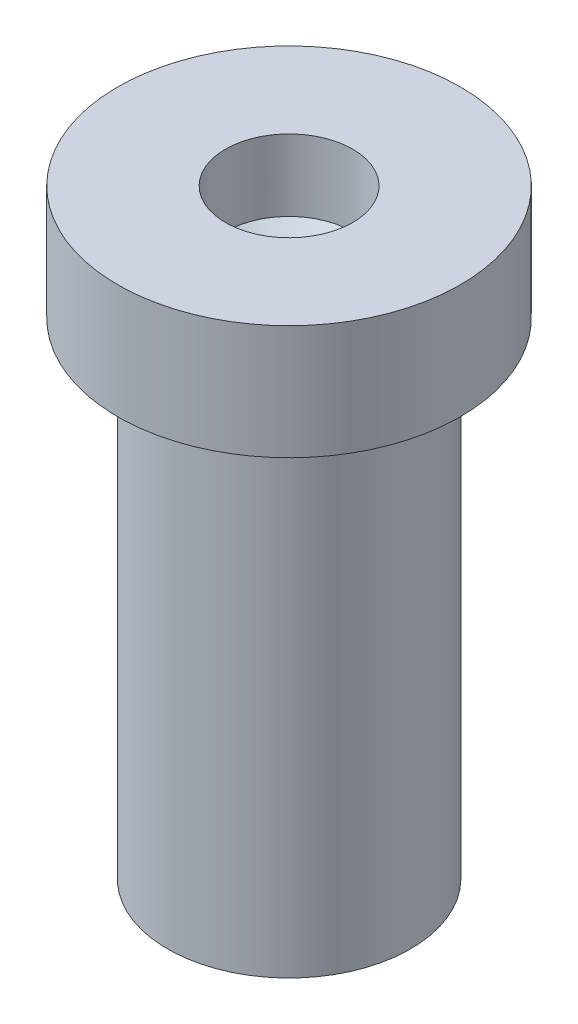
ISO-10303-21;
HEADER;
FILE_DESCRIPTION(('STEP AP214'),'2;1');
FILE_NAME('part.step','',(''),(''),'','','');
FILE_SCHEMA(('AUTOMOTIVE_DESIGN { 1 0 10303 214 1 1 1 1 }'));
ENDSEC;
DATA;
#1=APPLICATION_CONTEXT('core data for automotive mechanical design processes');
#2=APPLICATION_PROTOCOL_DEFINITION('international standard','automotive_design',2000,#1);
#3=PRODUCT_CONTEXT('',#1,'mechanical');
#4=PRODUCT('Part','Part','',(#3));
#5=PRODUCT_RELATED_PRODUCT_CATEGORY('part','',(#4));
#6=PRODUCT_DEFINITION_FORMATION('','',#4);
#7=PRODUCT_DEFINITION_CONTEXT('part definition',#1,'design');
#8=PRODUCT_DEFINITION('design','',#6,#7);
#9=PRODUCT_DEFINITION_SHAPE('','',#8);
#10=(LENGTH_UNIT() NAMED_UNIT(*) SI_UNIT(.MILLI.,.METRE.));
#11=(NAMED_UNIT(*) PLANE_ANGLE_UNIT() SI_UNIT($,.RADIAN.));
#12=(NAMED_UNIT(*) SI_UNIT($,.STERADIAN.) SOLID_ANGLE_UNIT());
#13=UNCERTAINTY_MEASURE_WITH_UNIT(LENGTH_MEASURE(1.E-05),#10,'distance_accuracy_value','');
#14=(GEOMETRIC_REPRESENTATION_CONTEXT(3) GLOBAL_UNCERTAINTY_ASSIGNED_CONTEXT((#13)) GLOBAL_UNIT_ASSIGNED_CONTEXT((#10,
#11,#12)) REPRESENTATION_CONTEXT('',''));
#15=CARTESIAN_POINT('',(0.,0.,0.));
#16=DIRECTION('',(0.,0.,1.));
#17=DIRECTION('',(1.,0.,0.));
#18=AXIS2_PLACEMENT_3D('',#15,#16,#17);
#19=CARTESIAN_POINT('',(0.,0.,0.));
#20=DIRECTION('',(0.,-1.,0.));
#21=DIRECTION('',(0.,0.,-1.));
#22=AXIS2_PLACEMENT_3D('',#19,#20,#21);
#23=PLANE('',#22);
#24=CARTESIAN_POINT('',(0.,0.,0.));
#25=DIRECTION('',(0.,-1.,0.));
#26=DIRECTION('',(0.,0.,-1.));
#27=AXIS2_PLACEMENT_3D('',#24,#25,#26);
#28=CIRCLE('',#27,1.75);
#29=CARTESIAN_POINT('',(0.,0.,-1.75));
#30=VERTEX_POINT('',#29);
#31=EDGE_CURVE('E11',#30,#30,#28,.T.);
#32=ORIENTED_EDGE('',*,*,#31,.T.);
#33=EDGE_LOOP('',(#32));
#34=FACE_BOUND('',#33,.T.);
#35=ADVANCED_FACE('F41',(#34),#23,.T.);
#36=CARTESIAN_POINT('',(0.,0.,0.));
#37=DIRECTION('',(0.,-1.,0.));
#38=DIRECTION('',(0.,0.,-1.));
#39=AXIS2_PLACEMENT_3D('',#36,#37,#38);
#40=CYLINDRICAL_SURFACE('',#39,1.75);
#41=CARTESIAN_POINT('',(0.,7.,0.));
#42=DIRECTION('',(0.,-1.,0.));
#43=DIRECTION('',(0.,0.,-1.));
#44=AXIS2_PLACEMENT_3D('',#41,#42,#43);
#45=CIRCLE('',#44,1.75);
#46=CARTESIAN_POINT('',(0.,7.,-1.75));
#47=VERTEX_POINT('',#46);
#48=EDGE_CURVE('E48',#47,#47,#45,.T.);
#49=ORIENTED_EDGE('',*,*,#48,.T.);
#50=EDGE_LOOP('',(#49));
#51=FACE_BOUND('',#50,.T.);
#52=ORIENTED_EDGE('',*,*,#31,.F.);
#53=EDGE_LOOP('',(#52));
#54=FACE_BOUND('',#53,.T.);
#55=ADVANCED_FACE('F78',(#51,#54),#40,.T.);
#56=CARTESIAN_POINT('',(1.75,7.,0.));
#57=DIRECTION('',(0.,-1.,0.));
#58=DIRECTION('',(0.,0.,-1.));
#59=AXIS2_PLACEMENT_3D('',#56,#57,#58);
#60=PLANE('',#59);
#61=CARTESIAN_POINT('',(0.,7.,0.));
#62=DIRECTION('',(0.,-1.,0.));
#63=DIRECTION('',(0.,0.,-1.));
#64=AXIS2_PLACEMENT_3D('',#61,#62,#63);
#65=CIRCLE('',#64,2.46865176765384);
#66=CARTESIAN_POINT('',(0.,7.,-2.46865176765384));
#67=VERTEX_POINT('',#66);
#68=EDGE_CURVE('E71',#67,#67,#65,.T.);
#69=ORIENTED_EDGE('',*,*,#68,.T.);
#70=EDGE_LOOP('',(#69));
#71=FACE_BOUND('',#70,.T.);
#72=ORIENTED_EDGE('',*,*,#48,.F.);
#73=EDGE_LOOP('',(#72));
#74=FACE_BOUND('',#73,.T.);
#75=ADVANCED_FACE('F81',(#71,#74),#60,.T.);
#76=CARTESIAN_POINT('',(0.,0.,0.));
#77=DIRECTION('',(0.,-1.,0.));
#78=DIRECTION('',(0.,0.,-1.));
#79=AXIS2_PLACEMENT_3D('',#76,#77,#78);
#80=CYLINDRICAL_SURFACE('',#79,2.46865176765384);
#81=CARTESIAN_POINT('',(0.,8.64756486241129,0.));
#82=DIRECTION('',(0.,-1.,0.));
#83=DIRECTION('',(0.,0.,-1.));
#84=AXIS2_PLACEMENT_3D('',#81,#82,#83);
#85=CIRCLE('',#84,2.46865176765384);
#86=CARTESIAN_POINT('',(0.,8.64756486241129,-2.46865176765384));
#87=VERTEX_POINT('',#86);
#88=EDGE_CURVE('E65',#87,#87,#85,.T.);
#89=ORIENTED_EDGE('',*,*,#88,.T.);
#90=EDGE_LOOP('',(#89));
#91=FACE_BOUND('',#90,.T.);
#92=ORIENTED_EDGE('',*,*,#68,.F.);
#93=EDGE_LOOP('',(#92));
#94=FACE_BOUND('',#93,.T.);
#95=ADVANCED_FACE('F83',(#91,#94),#80,.T.);
#96=CARTESIAN_POINT('',(2.46865176765384,8.64756486241129,0.));
#97=DIRECTION('',(0.,1.,0.));
#98=DIRECTION('',(0.,0.,1.));
#99=AXIS2_PLACEMENT_3D('',#96,#97,#98);
#100=PLANE('',#99);
#101=CARTESIAN_POINT('',(0.,8.64756486241129,0.));
#102=DIRECTION('',(0.,-1.,0.));
#103=DIRECTION('',(0.,0.,-1.));
#104=AXIS2_PLACEMENT_3D('',#101,#102,#103);
#105=CIRCLE('',#104,0.916559083152932);
#106=CARTESIAN_POINT('',(0.,8.64756486241129,-0.916559083152932));
#107=VERTEX_POINT('',#106);
#108=EDGE_CURVE('E61',#107,#107,#105,.T.);
#109=ORIENTED_EDGE('',*,*,#108,.T.);
#110=EDGE_LOOP('',(#109));
#111=FACE_BOUND('',#110,.T.);
#112=ORIENTED_EDGE('',*,*,#88,.F.);
#113=EDGE_LOOP('',(#112));
#114=FACE_BOUND('',#113,.T.);
#115=ADVANCED_FACE('F90',(#111,#114),#100,.T.);
#116=CARTESIAN_POINT('',(0.,0.,0.));
#117=DIRECTION('',(0.,-1.,0.));
#118=DIRECTION('',(0.,0.,-1.));
#119=AXIS2_PLACEMENT_3D('',#116,#117,#118);
#120=CYLINDRICAL_SURFACE('',#119,0.916559083152932);
#121=CARTESIAN_POINT('',(0.,7.61753971724251,0.));
#122=DIRECTION('',(0.,-1.,0.));
#123=DIRECTION('',(0.,0.,-1.));
#124=AXIS2_PLACEMENT_3D('',#121,#122,#123);
#125=CIRCLE('',#124,0.916559083152932);
#126=CARTESIAN_POINT('',(0.,7.61753971724251,-0.916559083152932));
#127=VERTEX_POINT('',#126);
#128=EDGE_CURVE('E58',#127,#127,#125,.T.);
#129=ORIENTED_EDGE('',*,*,#128,.T.);
#130=EDGE_LOOP('',(#129));
#131=FACE_BOUND('',#130,.T.);
#132=ORIENTED_EDGE('',*,*,#108,.F.);
#133=EDGE_LOOP('',(#132));
#134=FACE_BOUND('',#133,.T.);
#135=ADVANCED_FACE('F54',(#131,#134),#120,.F.);
#136=CARTESIAN_POINT('',(0.,7.61753971724251,0.));
#137=DIRECTION('',(0.,1.,0.));
#138=DIRECTION('',(0.,0.,1.));
#139=AXIS2_PLACEMENT_3D('',#136,#137,#138);
#140=CONICAL_SURFACE('',#139,0.916559083152932,0.97789986615985);
#141=CARTESIAN_POINT('',(0.,7.,0.));
#142=VERTEX_POINT('',#141);
#143=VERTEX_LOOP('',#142);
#144=FACE_BOUND('',#143,.T.);
#145=ORIENTED_EDGE('',*,*,#128,.F.);
#146=EDGE_LOOP('',(#145));
#147=FACE_BOUND('',#146,.T.);
#148=ADVANCED_FACE('F51',(#144,#147),#140,.F.);
#149=CLOSED_SHELL('',(#35,#55,#75,#95,#115,#135,#148));
#150=MANIFOLD_SOLID_BREP('B2',#149);
#151=ADVANCED_BREP_SHAPE_REPRESENTATION('',(#18,#150),#14);
#152=SHAPE_DEFINITION_REPRESENTATION(#9,#151);
ENDSEC;
END-ISO-10303-21;
